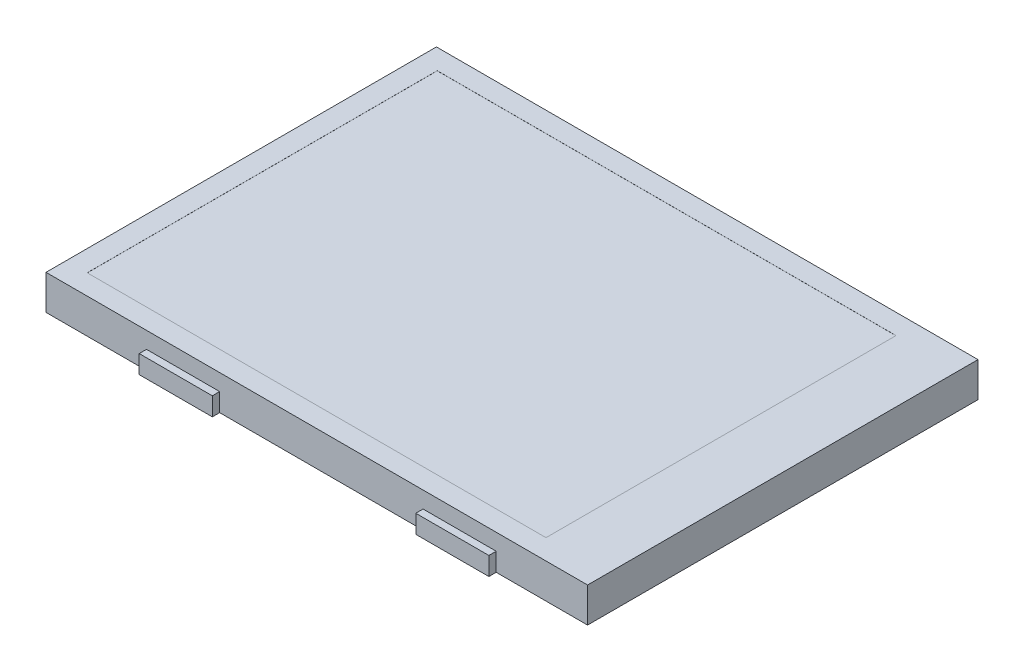
ISO-10303-21;
HEADER;
FILE_DESCRIPTION(('STEP AP214'),'2;1');
FILE_NAME('part.step','',(''),(''),'','','');
FILE_SCHEMA(('AUTOMOTIVE_DESIGN { 1 0 10303 214 1 1 1 1 }'));
ENDSEC;
DATA;
#1=APPLICATION_CONTEXT('core data for automotive mechanical design processes');
#2=APPLICATION_PROTOCOL_DEFINITION('international standard','automotive_design',2000,#1);
#3=PRODUCT_CONTEXT('',#1,'mechanical');
#4=PRODUCT('Part','Part','',(#3));
#5=PRODUCT_RELATED_PRODUCT_CATEGORY('part','',(#4));
#6=PRODUCT_DEFINITION_FORMATION('','',#4);
#7=PRODUCT_DEFINITION_CONTEXT('part definition',#1,'design');
#8=PRODUCT_DEFINITION('design','',#6,#7);
#9=PRODUCT_DEFINITION_SHAPE('','',#8);
#10=(LENGTH_UNIT() NAMED_UNIT(*) SI_UNIT(.MILLI.,.METRE.));
#11=(NAMED_UNIT(*) PLANE_ANGLE_UNIT() SI_UNIT($,.RADIAN.));
#12=(NAMED_UNIT(*) SI_UNIT($,.STERADIAN.) SOLID_ANGLE_UNIT());
#13=UNCERTAINTY_MEASURE_WITH_UNIT(LENGTH_MEASURE(1.E-05),#10,'distance_accuracy_value','');
#14=(GEOMETRIC_REPRESENTATION_CONTEXT(3) GLOBAL_UNCERTAINTY_ASSIGNED_CONTEXT((#13)) GLOBAL_UNIT_ASSIGNED_CONTEXT((#10,
#11,#12)) REPRESENTATION_CONTEXT('',''));
#15=CARTESIAN_POINT('',(0.,0.,0.));
#16=DIRECTION('',(0.,0.,1.));
#17=DIRECTION('',(1.,0.,0.));
#18=AXIS2_PLACEMENT_3D('',#15,#16,#17);
#19=CARTESIAN_POINT('',(-29.63,3.8,-21.36));
#20=DIRECTION('',(0.,0.,1.));
#21=DIRECTION('',(1.,0.,0.));
#22=AXIS2_PLACEMENT_3D('',#19,#20,#21);
#23=PLANE('',#22);
#24=DIRECTION('',(0.,-1.,0.));
#25=VECTOR('',#24,1.);
#26=CARTESIAN_POINT('',(19.63,0.,-21.36));
#27=LINE('',#26,#25);
#28=CARTESIAN_POINT('',(19.63,2.,-21.36));
#29=VERTEX_POINT('',#28);
#30=CARTESIAN_POINT('',(19.63,0.,-21.36));
#31=VERTEX_POINT('',#30);
#32=EDGE_CURVE('E67',#29,#31,#27,.T.);
#33=ORIENTED_EDGE('',*,*,#32,.F.);
#34=DIRECTION('',(1.,0.,0.));
#35=VECTOR('',#34,1.);
#36=CARTESIAN_POINT('',(19.63,2.,-21.36));
#37=LINE('',#36,#35);
#38=CARTESIAN_POINT('',(11.63,2.,-21.36));
#39=VERTEX_POINT('',#38);
#40=EDGE_CURVE('E251',#39,#29,#37,.T.);
#41=ORIENTED_EDGE('',*,*,#40,.F.);
#42=DIRECTION('',(0.,1.,0.));
#43=VECTOR('',#42,1.);
#44=CARTESIAN_POINT('',(11.63,2.,-21.36));
#45=LINE('',#44,#43);
#46=CARTESIAN_POINT('',(11.63,0.,-21.36));
#47=VERTEX_POINT('',#46);
#48=EDGE_CURVE('E262',#47,#39,#45,.T.);
#49=ORIENTED_EDGE('',*,*,#48,.F.);
#50=DIRECTION('',(-1.,0.,0.));
#51=VECTOR('',#50,1.);
#52=CARTESIAN_POINT('',(-29.63,0.,-21.36));
#53=LINE('',#52,#51);
#54=CARTESIAN_POINT('',(-10.63,0.,-21.36));
#55=VERTEX_POINT('',#54);
#56=EDGE_CURVE('E441',#47,#55,#53,.T.);
#57=ORIENTED_EDGE('',*,*,#56,.T.);
#58=DIRECTION('',(0.,-1.,0.));
#59=VECTOR('',#58,1.);
#60=CARTESIAN_POINT('',(-10.63,0.,-21.36));
#61=LINE('',#60,#59);
#62=CARTESIAN_POINT('',(-10.63,2.,-21.36));
#63=VERTEX_POINT('',#62);
#64=EDGE_CURVE('E313',#63,#55,#61,.T.);
#65=ORIENTED_EDGE('',*,*,#64,.F.);
#66=DIRECTION('',(1.,0.,0.));
#67=VECTOR('',#66,1.);
#68=CARTESIAN_POINT('',(-10.63,2.,-21.36));
#69=LINE('',#68,#67);
#70=CARTESIAN_POINT('',(-18.63,2.,-21.36));
#71=VERTEX_POINT('',#70);
#72=EDGE_CURVE('E294',#71,#63,#69,.T.);
#73=ORIENTED_EDGE('',*,*,#72,.F.);
#74=DIRECTION('',(0.,1.,0.));
#75=VECTOR('',#74,1.);
#76=CARTESIAN_POINT('',(-18.63,2.,-21.36));
#77=LINE('',#76,#75);
#78=CARTESIAN_POINT('',(-18.63,0.,-21.36));
#79=VERTEX_POINT('',#78);
#80=EDGE_CURVE('E300',#79,#71,#77,.T.);
#81=ORIENTED_EDGE('',*,*,#80,.F.);
#82=CARTESIAN_POINT('',(-29.63,0.,-21.36));
#83=VERTEX_POINT('',#82);
#84=EDGE_CURVE('E436',#79,#83,#53,.T.);
#85=ORIENTED_EDGE('',*,*,#84,.T.);
#86=DIRECTION('',(0.,-1.,0.));
#87=VECTOR('',#86,1.);
#88=CARTESIAN_POINT('',(-29.63,3.8,-21.36));
#89=LINE('',#88,#87);
#90=CARTESIAN_POINT('',(-29.63,3.8,-21.36));
#91=VERTEX_POINT('',#90);
#92=EDGE_CURVE('E52',#91,#83,#89,.T.);
#93=ORIENTED_EDGE('',*,*,#92,.F.);
#94=DIRECTION('',(-1.,0.,0.));
#95=VECTOR('',#94,1.);
#96=CARTESIAN_POINT('',(-29.63,3.8,-21.36));
#97=LINE('',#96,#95);
#98=CARTESIAN_POINT('',(29.63,3.8,-21.36));
#99=VERTEX_POINT('',#98);
#100=EDGE_CURVE('E422',#99,#91,#97,.T.);
#101=ORIENTED_EDGE('',*,*,#100,.F.);
#102=DIRECTION('',(0.,-1.,0.));
#103=VECTOR('',#102,1.);
#104=CARTESIAN_POINT('',(29.63,3.8,-21.36));
#105=LINE('',#104,#103);
#106=CARTESIAN_POINT('',(29.63,0.,-21.36));
#107=VERTEX_POINT('',#106);
#108=EDGE_CURVE('E11',#99,#107,#105,.T.);
#109=ORIENTED_EDGE('',*,*,#108,.T.);
#110=EDGE_CURVE('E437',#107,#31,#53,.T.);
#111=ORIENTED_EDGE('',*,*,#110,.T.);
#112=EDGE_LOOP('',(#33,#41,#49,#57,#65,#73,#81,#85,#93,#101,#109,#111));
#113=FACE_BOUND('',#112,.T.);
#114=ADVANCED_FACE('F43',(#113),#23,.F.);
#115=CARTESIAN_POINT('',(-29.63,3.8,21.36));
#116=DIRECTION('',(0.,0.,-1.));
#117=DIRECTION('',(-1.,0.,0.));
#118=AXIS2_PLACEMENT_3D('',#115,#116,#117);
#119=PLANE('',#118);
#120=DIRECTION('',(0.,-1.,0.));
#121=VECTOR('',#120,1.);
#122=CARTESIAN_POINT('',(11.63,2.,21.36));
#123=LINE('',#122,#121);
#124=CARTESIAN_POINT('',(11.63,2.,21.36));
#125=VERTEX_POINT('',#124);
#126=CARTESIAN_POINT('',(11.63,0.,21.36));
#127=VERTEX_POINT('',#126);
#128=EDGE_CURVE('E335',#125,#127,#123,.T.);
#129=ORIENTED_EDGE('',*,*,#128,.F.);
#130=DIRECTION('',(-1.,0.,0.));
#131=VECTOR('',#130,1.);
#132=CARTESIAN_POINT('',(11.63,2.,21.36));
#133=LINE('',#132,#131);
#134=CARTESIAN_POINT('',(19.63,2.,21.36));
#135=VERTEX_POINT('',#134);
#136=EDGE_CURVE('E341',#135,#125,#133,.T.);
#137=ORIENTED_EDGE('',*,*,#136,.F.);
#138=DIRECTION('',(0.,1.,0.));
#139=VECTOR('',#138,1.);
#140=CARTESIAN_POINT('',(19.63,2.,21.36));
#141=LINE('',#140,#139);
#142=CARTESIAN_POINT('',(19.63,0.,21.36));
#143=VERTEX_POINT('',#142);
#144=EDGE_CURVE('E354',#143,#135,#141,.T.);
#145=ORIENTED_EDGE('',*,*,#144,.F.);
#146=DIRECTION('',(1.,0.,0.));
#147=VECTOR('',#146,1.);
#148=CARTESIAN_POINT('',(-29.63,0.,21.36));
#149=LINE('',#148,#147);
#150=CARTESIAN_POINT('',(29.63,0.,21.36));
#151=VERTEX_POINT('',#150);
#152=EDGE_CURVE('E444',#143,#151,#149,.T.);
#153=ORIENTED_EDGE('',*,*,#152,.T.);
#154=DIRECTION('',(0.,-1.,0.));
#155=VECTOR('',#154,1.);
#156=CARTESIAN_POINT('',(29.63,3.8,21.36));
#157=LINE('',#156,#155);
#158=CARTESIAN_POINT('',(29.63,3.8,21.36));
#159=VERTEX_POINT('',#158);
#160=EDGE_CURVE('E432',#159,#151,#157,.T.);
#161=ORIENTED_EDGE('',*,*,#160,.F.);
#162=DIRECTION('',(1.,0.,0.));
#163=VECTOR('',#162,1.);
#164=CARTESIAN_POINT('',(-29.63,3.8,21.36));
#165=LINE('',#164,#163);
#166=CARTESIAN_POINT('',(-29.63,3.8,21.36));
#167=VERTEX_POINT('',#166);
#168=EDGE_CURVE('E429',#167,#159,#165,.T.);
#169=ORIENTED_EDGE('',*,*,#168,.F.);
#170=DIRECTION('',(0.,-1.,0.));
#171=VECTOR('',#170,1.);
#172=CARTESIAN_POINT('',(-29.63,3.8,21.36));
#173=LINE('',#172,#171);
#174=CARTESIAN_POINT('',(-29.63,0.,21.36));
#175=VERTEX_POINT('',#174);
#176=EDGE_CURVE('E451',#167,#175,#173,.T.);
#177=ORIENTED_EDGE('',*,*,#176,.T.);
#178=CARTESIAN_POINT('',(-18.63,0.,21.36));
#179=VERTEX_POINT('',#178);
#180=EDGE_CURVE('E423',#175,#179,#149,.T.);
#181=ORIENTED_EDGE('',*,*,#180,.T.);
#182=DIRECTION('',(0.,-1.,0.));
#183=VECTOR('',#182,1.);
#184=CARTESIAN_POINT('',(-18.63,2.,21.36));
#185=LINE('',#184,#183);
#186=CARTESIAN_POINT('',(-18.63,2.,21.36));
#187=VERTEX_POINT('',#186);
#188=EDGE_CURVE('E376',#187,#179,#185,.T.);
#189=ORIENTED_EDGE('',*,*,#188,.F.);
#190=DIRECTION('',(-1.,0.,0.));
#191=VECTOR('',#190,1.);
#192=CARTESIAN_POINT('',(-18.63,2.,21.36));
#193=LINE('',#192,#191);
#194=CARTESIAN_POINT('',(-10.63,2.,21.36));
#195=VERTEX_POINT('',#194);
#196=EDGE_CURVE('E382',#195,#187,#193,.T.);
#197=ORIENTED_EDGE('',*,*,#196,.F.);
#198=DIRECTION('',(0.,1.,0.));
#199=VECTOR('',#198,1.);
#200=CARTESIAN_POINT('',(-10.63,2.,21.36));
#201=LINE('',#200,#199);
#202=CARTESIAN_POINT('',(-10.63,0.,21.36));
#203=VERTEX_POINT('',#202);
#204=EDGE_CURVE('E395',#203,#195,#201,.T.);
#205=ORIENTED_EDGE('',*,*,#204,.F.);
#206=EDGE_CURVE('E447',#203,#127,#149,.T.);
#207=ORIENTED_EDGE('',*,*,#206,.T.);
#208=EDGE_LOOP('',(#129,#137,#145,#153,#161,#169,#177,#181,#189,#197,#205,#207));
#209=FACE_BOUND('',#208,.T.);
#210=ADVANCED_FACE('F470',(#209),#119,.F.);
#211=CARTESIAN_POINT('',(29.63,3.8,21.36));
#212=DIRECTION('',(-1.,0.,0.));
#213=DIRECTION('',(0.,0.,1.));
#214=AXIS2_PLACEMENT_3D('',#211,#212,#213);
#215=PLANE('',#214);
#216=DIRECTION('',(0.,0.,-1.));
#217=VECTOR('',#216,1.);
#218=CARTESIAN_POINT('',(29.63,0.,21.36));
#219=LINE('',#218,#217);
#220=EDGE_CURVE('E417',#151,#107,#219,.T.);
#221=ORIENTED_EDGE('',*,*,#220,.T.);
#222=ORIENTED_EDGE('',*,*,#108,.F.);
#223=DIRECTION('',(0.,0.,-1.));
#224=VECTOR('',#223,1.);
#225=CARTESIAN_POINT('',(29.63,3.8,21.36));
#226=LINE('',#225,#224);
#227=EDGE_CURVE('E418',#159,#99,#226,.T.);
#228=ORIENTED_EDGE('',*,*,#227,.F.);
#229=ORIENTED_EDGE('',*,*,#160,.T.);
#230=EDGE_LOOP('',(#221,#222,#228,#229));
#231=FACE_BOUND('',#230,.T.);
#232=ADVANCED_FACE('F45',(#231),#215,.F.);
#233=CARTESIAN_POINT('',(-29.63,3.8,21.36));
#234=DIRECTION('',(1.,0.,0.));
#235=DIRECTION('',(0.,0.,-1.));
#236=AXIS2_PLACEMENT_3D('',#233,#234,#235);
#237=PLANE('',#236);
#238=DIRECTION('',(0.,0.,1.));
#239=VECTOR('',#238,1.);
#240=CARTESIAN_POINT('',(-29.63,0.,21.36));
#241=LINE('',#240,#239);
#242=EDGE_CURVE('E440',#83,#175,#241,.T.);
#243=ORIENTED_EDGE('',*,*,#242,.T.);
#244=ORIENTED_EDGE('',*,*,#176,.F.);
#245=DIRECTION('',(0.,0.,1.));
#246=VECTOR('',#245,1.);
#247=CARTESIAN_POINT('',(-29.63,3.8,21.36));
#248=LINE('',#247,#246);
#249=EDGE_CURVE('E426',#91,#167,#248,.T.);
#250=ORIENTED_EDGE('',*,*,#249,.F.);
#251=ORIENTED_EDGE('',*,*,#92,.T.);
#252=EDGE_LOOP('',(#243,#244,#250,#251));
#253=FACE_BOUND('',#252,.T.);
#254=ADVANCED_FACE('F460',(#253),#237,.F.);
#255=CARTESIAN_POINT('',(0.,3.8,0.));
#256=DIRECTION('',(0.,-1.,0.));
#257=DIRECTION('',(0.,0.,-1.));
#258=AXIS2_PLACEMENT_3D('',#255,#256,#257);
#259=PLANE('',#258);
#260=DIRECTION('',(1.,0.,0.));
#261=VECTOR('',#260,1.);
#262=CARTESIAN_POINT('',(-27.33,3.8,19.15));
#263=LINE('',#262,#261);
#264=CARTESIAN_POINT('',(-27.33,3.8,19.15));
#265=VERTEX_POINT('',#264);
#266=CARTESIAN_POINT('',(22.87,3.8,19.15));
#267=VERTEX_POINT('',#266);
#268=EDGE_CURVE('E243',#265,#267,#263,.T.);
#269=ORIENTED_EDGE('',*,*,#268,.F.);
#270=DIRECTION('',(0.,0.,1.));
#271=VECTOR('',#270,1.);
#272=CARTESIAN_POINT('',(-27.33,3.8,-19.15));
#273=LINE('',#272,#271);
#274=CARTESIAN_POINT('',(-27.33,3.8,-19.15));
#275=VERTEX_POINT('',#274);
#276=EDGE_CURVE('E59',#275,#265,#273,.T.);
#277=ORIENTED_EDGE('',*,*,#276,.F.);
#278=DIRECTION('',(-1.,0.,0.));
#279=VECTOR('',#278,1.);
#280=CARTESIAN_POINT('',(-27.33,3.8,-19.15));
#281=LINE('',#280,#279);
#282=CARTESIAN_POINT('',(22.87,3.8,-19.15));
#283=VERTEX_POINT('',#282);
#284=EDGE_CURVE('E228',#283,#275,#281,.T.);
#285=ORIENTED_EDGE('',*,*,#284,.F.);
#286=DIRECTION('',(0.,0.,-1.));
#287=VECTOR('',#286,1.);
#288=CARTESIAN_POINT('',(22.87,3.8,-19.15));
#289=LINE('',#288,#287);
#290=EDGE_CURVE('E234',#267,#283,#289,.T.);
#291=ORIENTED_EDGE('',*,*,#290,.F.);
#292=EDGE_LOOP('',(#269,#277,#285,#291));
#293=FACE_BOUND('',#292,.T.);
#294=ORIENTED_EDGE('',*,*,#227,.T.);
#295=ORIENTED_EDGE('',*,*,#100,.T.);
#296=ORIENTED_EDGE('',*,*,#249,.T.);
#297=ORIENTED_EDGE('',*,*,#168,.T.);
#298=EDGE_LOOP('',(#294,#295,#296,#297));
#299=FACE_BOUND('',#298,.T.);
#300=ADVANCED_FACE('F475',(#293,#299),#259,.F.);
#301=CARTESIAN_POINT('',(0.,0.,0.));
#302=DIRECTION('',(0.,-1.,0.));
#303=DIRECTION('',(0.,0.,-1.));
#304=AXIS2_PLACEMENT_3D('',#301,#302,#303);
#305=PLANE('',#304);
#306=ORIENTED_EDGE('',*,*,#220,.F.);
#307=ORIENTED_EDGE('',*,*,#152,.F.);
#308=DIRECTION('',(0.,0.,-1.));
#309=VECTOR('',#308,1.);
#310=CARTESIAN_POINT('',(19.63,0.,22.16));
#311=LINE('',#310,#309);
#312=CARTESIAN_POINT('',(19.63,0.,22.16));
#313=VERTEX_POINT('',#312);
#314=EDGE_CURVE('E368',#313,#143,#311,.T.);
#315=ORIENTED_EDGE('',*,*,#314,.F.);
#316=DIRECTION('',(1.,0.,0.));
#317=VECTOR('',#316,1.);
#318=CARTESIAN_POINT('',(11.63,0.,22.16));
#319=LINE('',#318,#317);
#320=CARTESIAN_POINT('',(11.63,0.,22.16));
#321=VERTEX_POINT('',#320);
#322=EDGE_CURVE('E340',#321,#313,#319,.T.);
#323=ORIENTED_EDGE('',*,*,#322,.F.);
#324=DIRECTION('',(0.,0.,-1.));
#325=VECTOR('',#324,1.);
#326=CARTESIAN_POINT('',(11.63,0.,22.16));
#327=LINE('',#326,#325);
#328=EDGE_CURVE('E372',#321,#127,#327,.T.);
#329=ORIENTED_EDGE('',*,*,#328,.T.);
#330=ORIENTED_EDGE('',*,*,#206,.F.);
#331=DIRECTION('',(0.,0.,-1.));
#332=VECTOR('',#331,1.);
#333=CARTESIAN_POINT('',(-10.63,0.,22.16));
#334=LINE('',#333,#332);
#335=CARTESIAN_POINT('',(-10.63,0.,22.16));
#336=VERTEX_POINT('',#335);
#337=EDGE_CURVE('E409',#336,#203,#334,.T.);
#338=ORIENTED_EDGE('',*,*,#337,.F.);
#339=DIRECTION('',(1.,0.,0.));
#340=VECTOR('',#339,1.);
#341=CARTESIAN_POINT('',(-18.63,0.,22.16));
#342=LINE('',#341,#340);
#343=CARTESIAN_POINT('',(-18.63,0.,22.16));
#344=VERTEX_POINT('',#343);
#345=EDGE_CURVE('E381',#344,#336,#342,.T.);
#346=ORIENTED_EDGE('',*,*,#345,.F.);
#347=DIRECTION('',(0.,0.,-1.));
#348=VECTOR('',#347,1.);
#349=CARTESIAN_POINT('',(-18.63,0.,22.16));
#350=LINE('',#349,#348);
#351=EDGE_CURVE('E413',#344,#179,#350,.T.);
#352=ORIENTED_EDGE('',*,*,#351,.T.);
#353=ORIENTED_EDGE('',*,*,#180,.F.);
#354=ORIENTED_EDGE('',*,*,#242,.F.);
#355=ORIENTED_EDGE('',*,*,#84,.F.);
#356=DIRECTION('',(0.,0.,1.));
#357=VECTOR('',#356,1.);
#358=CARTESIAN_POINT('',(-18.63,0.,-22.16));
#359=LINE('',#358,#357);
#360=CARTESIAN_POINT('',(-18.63,0.,-22.16));
#361=VERTEX_POINT('',#360);
#362=EDGE_CURVE('E323',#361,#79,#359,.T.);
#363=ORIENTED_EDGE('',*,*,#362,.F.);
#364=DIRECTION('',(-1.,0.,0.));
#365=VECTOR('',#364,1.);
#366=CARTESIAN_POINT('',(-18.63,0.,-22.16));
#367=LINE('',#366,#365);
#368=CARTESIAN_POINT('',(-10.63,0.,-22.16));
#369=VERTEX_POINT('',#368);
#370=EDGE_CURVE('E303',#369,#361,#367,.T.);
#371=ORIENTED_EDGE('',*,*,#370,.F.);
#372=DIRECTION('',(0.,0.,1.));
#373=VECTOR('',#372,1.);
#374=CARTESIAN_POINT('',(-10.63,0.,-22.16));
#375=LINE('',#374,#373);
#376=EDGE_CURVE('E327',#369,#55,#375,.T.);
#377=ORIENTED_EDGE('',*,*,#376,.T.);
#378=ORIENTED_EDGE('',*,*,#56,.F.);
#379=DIRECTION('',(0.,0.,1.));
#380=VECTOR('',#379,1.);
#381=CARTESIAN_POINT('',(11.63,0.,-22.16));
#382=LINE('',#381,#380);
#383=CARTESIAN_POINT('',(11.63,0.,-22.16));
#384=VERTEX_POINT('',#383);
#385=EDGE_CURVE('E283',#384,#47,#382,.T.);
#386=ORIENTED_EDGE('',*,*,#385,.F.);
#387=DIRECTION('',(-1.,0.,0.));
#388=VECTOR('',#387,1.);
#389=CARTESIAN_POINT('',(11.63,0.,-22.16));
#390=LINE('',#389,#388);
#391=CARTESIAN_POINT('',(19.63,0.,-22.16));
#392=VERTEX_POINT('',#391);
#393=EDGE_CURVE('E265',#392,#384,#390,.T.);
#394=ORIENTED_EDGE('',*,*,#393,.F.);
#395=DIRECTION('',(0.,0.,1.));
#396=VECTOR('',#395,1.);
#397=CARTESIAN_POINT('',(19.63,0.,-22.16));
#398=LINE('',#397,#396);
#399=EDGE_CURVE('E287',#392,#31,#398,.T.);
#400=ORIENTED_EDGE('',*,*,#399,.T.);
#401=ORIENTED_EDGE('',*,*,#110,.F.);
#402=EDGE_LOOP('',(#306,#307,#315,#323,#329,#330,#338,#346,#352,#353,#354,#355,#363,#371,#377,
#378,#386,#394,#400,#401));
#403=FACE_BOUND('',#402,.T.);
#404=ADVANCED_FACE('F466',(#403),#305,.T.);
#405=CARTESIAN_POINT('',(-18.63,2.,22.16));
#406=DIRECTION('',(1.,0.,0.));
#407=DIRECTION('',(0.,0.,-1.));
#408=AXIS2_PLACEMENT_3D('',#405,#406,#407);
#409=PLANE('',#408);
#410=ORIENTED_EDGE('',*,*,#188,.T.);
#411=ORIENTED_EDGE('',*,*,#351,.F.);
#412=DIRECTION('',(0.,-1.,0.));
#413=VECTOR('',#412,1.);
#414=CARTESIAN_POINT('',(-18.63,2.,22.16));
#415=LINE('',#414,#413);
#416=CARTESIAN_POINT('',(-18.63,2.,22.16));
#417=VERTEX_POINT('',#416);
#418=EDGE_CURVE('E377',#417,#344,#415,.T.);
#419=ORIENTED_EDGE('',*,*,#418,.F.);
#420=DIRECTION('',(0.,0.,-1.));
#421=VECTOR('',#420,1.);
#422=CARTESIAN_POINT('',(-18.63,2.,22.16));
#423=LINE('',#422,#421);
#424=EDGE_CURVE('E391',#417,#187,#423,.T.);
#425=ORIENTED_EDGE('',*,*,#424,.T.);
#426=EDGE_LOOP('',(#410,#411,#419,#425));
#427=FACE_BOUND('',#426,.T.);
#428=ADVANCED_FACE('F529',(#427),#409,.F.);
#429=CARTESIAN_POINT('',(-10.63,2.,22.16));
#430=DIRECTION('',(-1.,0.,0.));
#431=DIRECTION('',(0.,0.,1.));
#432=AXIS2_PLACEMENT_3D('',#429,#430,#431);
#433=PLANE('',#432);
#434=ORIENTED_EDGE('',*,*,#204,.T.);
#435=DIRECTION('',(0.,0.,-1.));
#436=VECTOR('',#435,1.);
#437=CARTESIAN_POINT('',(-10.63,2.,22.16));
#438=LINE('',#437,#436);
#439=CARTESIAN_POINT('',(-10.63,2.,22.16));
#440=VERTEX_POINT('',#439);
#441=EDGE_CURVE('E405',#440,#195,#438,.T.);
#442=ORIENTED_EDGE('',*,*,#441,.F.);
#443=DIRECTION('',(0.,1.,0.));
#444=VECTOR('',#443,1.);
#445=CARTESIAN_POINT('',(-10.63,2.,22.16));
#446=LINE('',#445,#444);
#447=EDGE_CURVE('E385',#336,#440,#446,.T.);
#448=ORIENTED_EDGE('',*,*,#447,.F.);
#449=ORIENTED_EDGE('',*,*,#337,.T.);
#450=EDGE_LOOP('',(#434,#442,#448,#449));
#451=FACE_BOUND('',#450,.T.);
#452=ADVANCED_FACE('F535',(#451),#433,.F.);
#453=CARTESIAN_POINT('',(-18.63,2.,22.16));
#454=DIRECTION('',(0.,-1.,0.));
#455=DIRECTION('',(0.,0.,-1.));
#456=AXIS2_PLACEMENT_3D('',#453,#454,#455);
#457=PLANE('',#456);
#458=ORIENTED_EDGE('',*,*,#196,.T.);
#459=ORIENTED_EDGE('',*,*,#424,.F.);
#460=DIRECTION('',(-1.,0.,0.));
#461=VECTOR('',#460,1.);
#462=CARTESIAN_POINT('',(-18.63,2.,22.16));
#463=LINE('',#462,#461);
#464=EDGE_CURVE('E388',#440,#417,#463,.T.);
#465=ORIENTED_EDGE('',*,*,#464,.F.);
#466=ORIENTED_EDGE('',*,*,#441,.T.);
#467=EDGE_LOOP('',(#458,#459,#465,#466));
#468=FACE_BOUND('',#467,.T.);
#469=ADVANCED_FACE('F539',(#468),#457,.F.);
#470=CARTESIAN_POINT('',(0.,0.,22.16));
#471=DIRECTION('',(0.,0.,1.));
#472=DIRECTION('',(1.,0.,0.));
#473=AXIS2_PLACEMENT_3D('',#470,#471,#472);
#474=PLANE('',#473);
#475=ORIENTED_EDGE('',*,*,#418,.T.);
#476=ORIENTED_EDGE('',*,*,#345,.T.);
#477=ORIENTED_EDGE('',*,*,#447,.T.);
#478=ORIENTED_EDGE('',*,*,#464,.T.);
#479=EDGE_LOOP('',(#475,#476,#477,#478));
#480=FACE_BOUND('',#479,.T.);
#481=ADVANCED_FACE('F543',(#480),#474,.T.);
#482=CARTESIAN_POINT('',(11.63,2.,22.16));
#483=DIRECTION('',(1.,0.,0.));
#484=DIRECTION('',(0.,0.,-1.));
#485=AXIS2_PLACEMENT_3D('',#482,#483,#484);
#486=PLANE('',#485);
#487=ORIENTED_EDGE('',*,*,#128,.T.);
#488=ORIENTED_EDGE('',*,*,#328,.F.);
#489=DIRECTION('',(0.,-1.,0.));
#490=VECTOR('',#489,1.);
#491=CARTESIAN_POINT('',(11.63,2.,22.16));
#492=LINE('',#491,#490);
#493=CARTESIAN_POINT('',(11.63,2.,22.16));
#494=VERTEX_POINT('',#493);
#495=EDGE_CURVE('E336',#494,#321,#492,.T.);
#496=ORIENTED_EDGE('',*,*,#495,.F.);
#497=DIRECTION('',(0.,0.,-1.));
#498=VECTOR('',#497,1.);
#499=CARTESIAN_POINT('',(11.63,2.,22.16));
#500=LINE('',#499,#498);
#501=EDGE_CURVE('E350',#494,#125,#500,.T.);
#502=ORIENTED_EDGE('',*,*,#501,.T.);
#503=EDGE_LOOP('',(#487,#488,#496,#502));
#504=FACE_BOUND('',#503,.T.);
#505=ADVANCED_FACE('F547',(#504),#486,.F.);
#506=CARTESIAN_POINT('',(19.63,2.,22.16));
#507=DIRECTION('',(-1.,0.,0.));
#508=DIRECTION('',(0.,0.,1.));
#509=AXIS2_PLACEMENT_3D('',#506,#507,#508);
#510=PLANE('',#509);
#511=ORIENTED_EDGE('',*,*,#144,.T.);
#512=DIRECTION('',(0.,0.,-1.));
#513=VECTOR('',#512,1.);
#514=CARTESIAN_POINT('',(19.63,2.,22.16));
#515=LINE('',#514,#513);
#516=CARTESIAN_POINT('',(19.63,2.,22.16));
#517=VERTEX_POINT('',#516);
#518=EDGE_CURVE('E364',#517,#135,#515,.T.);
#519=ORIENTED_EDGE('',*,*,#518,.F.);
#520=DIRECTION('',(0.,1.,0.));
#521=VECTOR('',#520,1.);
#522=CARTESIAN_POINT('',(19.63,2.,22.16));
#523=LINE('',#522,#521);
#524=EDGE_CURVE('E344',#313,#517,#523,.T.);
#525=ORIENTED_EDGE('',*,*,#524,.F.);
#526=ORIENTED_EDGE('',*,*,#314,.T.);
#527=EDGE_LOOP('',(#511,#519,#525,#526));
#528=FACE_BOUND('',#527,.T.);
#529=ADVANCED_FACE('F551',(#528),#510,.F.);
#530=CARTESIAN_POINT('',(11.63,2.,22.16));
#531=DIRECTION('',(0.,-1.,0.));
#532=DIRECTION('',(0.,0.,-1.));
#533=AXIS2_PLACEMENT_3D('',#530,#531,#532);
#534=PLANE('',#533);
#535=ORIENTED_EDGE('',*,*,#136,.T.);
#536=ORIENTED_EDGE('',*,*,#501,.F.);
#537=DIRECTION('',(-1.,0.,0.));
#538=VECTOR('',#537,1.);
#539=CARTESIAN_POINT('',(11.63,2.,22.16));
#540=LINE('',#539,#538);
#541=EDGE_CURVE('E347',#517,#494,#540,.T.);
#542=ORIENTED_EDGE('',*,*,#541,.F.);
#543=ORIENTED_EDGE('',*,*,#518,.T.);
#544=EDGE_LOOP('',(#535,#536,#542,#543));
#545=FACE_BOUND('',#544,.T.);
#546=ADVANCED_FACE('F555',(#545),#534,.F.);
#547=CARTESIAN_POINT('',(0.,0.,22.16));
#548=DIRECTION('',(0.,0.,1.));
#549=DIRECTION('',(1.,0.,0.));
#550=AXIS2_PLACEMENT_3D('',#547,#548,#549);
#551=PLANE('',#550);
#552=ORIENTED_EDGE('',*,*,#495,.T.);
#553=ORIENTED_EDGE('',*,*,#322,.T.);
#554=ORIENTED_EDGE('',*,*,#524,.T.);
#555=ORIENTED_EDGE('',*,*,#541,.T.);
#556=EDGE_LOOP('',(#552,#553,#554,#555));
#557=FACE_BOUND('',#556,.T.);
#558=ADVANCED_FACE('F517',(#557),#551,.T.);
#559=CARTESIAN_POINT('',(-10.63,2.,-22.16));
#560=DIRECTION('',(0.,-1.,0.));
#561=DIRECTION('',(0.,0.,-1.));
#562=AXIS2_PLACEMENT_3D('',#559,#560,#561);
#563=PLANE('',#562);
#564=ORIENTED_EDGE('',*,*,#72,.T.);
#565=DIRECTION('',(0.,0.,1.));
#566=VECTOR('',#565,1.);
#567=CARTESIAN_POINT('',(-10.63,2.,-22.16));
#568=LINE('',#567,#566);
#569=CARTESIAN_POINT('',(-10.63,2.,-22.16));
#570=VERTEX_POINT('',#569);
#571=EDGE_CURVE('E331',#570,#63,#568,.T.);
#572=ORIENTED_EDGE('',*,*,#571,.F.);
#573=DIRECTION('',(1.,0.,0.));
#574=VECTOR('',#573,1.);
#575=CARTESIAN_POINT('',(-10.63,2.,-22.16));
#576=LINE('',#575,#574);
#577=CARTESIAN_POINT('',(-18.63,2.,-22.16));
#578=VERTEX_POINT('',#577);
#579=EDGE_CURVE('E295',#578,#570,#576,.T.);
#580=ORIENTED_EDGE('',*,*,#579,.F.);
#581=DIRECTION('',(0.,0.,1.));
#582=VECTOR('',#581,1.);
#583=CARTESIAN_POINT('',(-18.63,2.,-22.16));
#584=LINE('',#583,#582);
#585=EDGE_CURVE('E309',#578,#71,#584,.T.);
#586=ORIENTED_EDGE('',*,*,#585,.T.);
#587=EDGE_LOOP('',(#564,#572,#580,#586));
#588=FACE_BOUND('',#587,.T.);
#589=ADVANCED_FACE('F504',(#588),#563,.F.);
#590=CARTESIAN_POINT('',(-10.63,0.,-22.16));
#591=DIRECTION('',(-1.,0.,0.));
#592=DIRECTION('',(0.,0.,1.));
#593=AXIS2_PLACEMENT_3D('',#590,#591,#592);
#594=PLANE('',#593);
#595=ORIENTED_EDGE('',*,*,#64,.T.);
#596=ORIENTED_EDGE('',*,*,#376,.F.);
#597=DIRECTION('',(0.,-1.,0.));
#598=VECTOR('',#597,1.);
#599=CARTESIAN_POINT('',(-10.63,0.,-22.16));
#600=LINE('',#599,#598);
#601=EDGE_CURVE('E299',#570,#369,#600,.T.);
#602=ORIENTED_EDGE('',*,*,#601,.F.);
#603=ORIENTED_EDGE('',*,*,#571,.T.);
#604=EDGE_LOOP('',(#595,#596,#602,#603));
#605=FACE_BOUND('',#604,.T.);
#606=ADVANCED_FACE('F509',(#605),#594,.F.);
#607=CARTESIAN_POINT('',(-18.63,2.,-22.16));
#608=DIRECTION('',(1.,0.,0.));
#609=DIRECTION('',(0.,0.,-1.));
#610=AXIS2_PLACEMENT_3D('',#607,#608,#609);
#611=PLANE('',#610);
#612=ORIENTED_EDGE('',*,*,#80,.T.);
#613=ORIENTED_EDGE('',*,*,#585,.F.);
#614=DIRECTION('',(0.,1.,0.));
#615=VECTOR('',#614,1.);
#616=CARTESIAN_POINT('',(-18.63,2.,-22.16));
#617=LINE('',#616,#615);
#618=EDGE_CURVE('E306',#361,#578,#617,.T.);
#619=ORIENTED_EDGE('',*,*,#618,.F.);
#620=ORIENTED_EDGE('',*,*,#362,.T.);
#621=EDGE_LOOP('',(#612,#613,#619,#620));
#622=FACE_BOUND('',#621,.T.);
#623=ADVANCED_FACE('F500',(#622),#611,.F.);
#624=CARTESIAN_POINT('',(0.,0.,-22.16));
#625=DIRECTION('',(0.,0.,1.));
#626=DIRECTION('',(1.,0.,0.));
#627=AXIS2_PLACEMENT_3D('',#624,#625,#626);
#628=PLANE('',#627);
#629=ORIENTED_EDGE('',*,*,#579,.T.);
#630=ORIENTED_EDGE('',*,*,#601,.T.);
#631=ORIENTED_EDGE('',*,*,#370,.T.);
#632=ORIENTED_EDGE('',*,*,#618,.T.);
#633=EDGE_LOOP('',(#629,#630,#631,#632));
#634=FACE_BOUND('',#633,.T.);
#635=ADVANCED_FACE('F507',(#634),#628,.F.);
#636=CARTESIAN_POINT('',(19.63,2.,-22.16));
#637=DIRECTION('',(0.,-1.,0.));
#638=DIRECTION('',(0.,0.,-1.));
#639=AXIS2_PLACEMENT_3D('',#636,#637,#638);
#640=PLANE('',#639);
#641=ORIENTED_EDGE('',*,*,#40,.T.);
#642=DIRECTION('',(0.,0.,1.));
#643=VECTOR('',#642,1.);
#644=CARTESIAN_POINT('',(19.63,2.,-22.16));
#645=LINE('',#644,#643);
#646=CARTESIAN_POINT('',(19.63,2.,-22.16));
#647=VERTEX_POINT('',#646);
#648=EDGE_CURVE('E291',#647,#29,#645,.T.);
#649=ORIENTED_EDGE('',*,*,#648,.F.);
#650=DIRECTION('',(1.,0.,0.));
#651=VECTOR('',#650,1.);
#652=CARTESIAN_POINT('',(19.63,2.,-22.16));
#653=LINE('',#652,#651);
#654=CARTESIAN_POINT('',(11.63,2.,-22.16));
#655=VERTEX_POINT('',#654);
#656=EDGE_CURVE('E257',#655,#647,#653,.T.);
#657=ORIENTED_EDGE('',*,*,#656,.F.);
#658=DIRECTION('',(0.,0.,1.));
#659=VECTOR('',#658,1.);
#660=CARTESIAN_POINT('',(11.63,2.,-22.16));
#661=LINE('',#660,#659);
#662=EDGE_CURVE('E271',#655,#39,#661,.T.);
#663=ORIENTED_EDGE('',*,*,#662,.T.);
#664=EDGE_LOOP('',(#641,#649,#657,#663));
#665=FACE_BOUND('',#664,.T.);
#666=ADVANCED_FACE('F488',(#665),#640,.F.);
#667=CARTESIAN_POINT('',(19.63,0.,-22.16));
#668=DIRECTION('',(-1.,0.,0.));
#669=DIRECTION('',(0.,0.,1.));
#670=AXIS2_PLACEMENT_3D('',#667,#668,#669);
#671=PLANE('',#670);
#672=ORIENTED_EDGE('',*,*,#32,.T.);
#673=ORIENTED_EDGE('',*,*,#399,.F.);
#674=DIRECTION('',(0.,-1.,0.));
#675=VECTOR('',#674,1.);
#676=CARTESIAN_POINT('',(19.63,0.,-22.16));
#677=LINE('',#676,#675);
#678=EDGE_CURVE('E261',#647,#392,#677,.T.);
#679=ORIENTED_EDGE('',*,*,#678,.F.);
#680=ORIENTED_EDGE('',*,*,#648,.T.);
#681=EDGE_LOOP('',(#672,#673,#679,#680));
#682=FACE_BOUND('',#681,.T.);
#683=ADVANCED_FACE('F484',(#682),#671,.F.);
#684=CARTESIAN_POINT('',(11.63,2.,-22.16));
#685=DIRECTION('',(1.,0.,0.));
#686=DIRECTION('',(0.,0.,-1.));
#687=AXIS2_PLACEMENT_3D('',#684,#685,#686);
#688=PLANE('',#687);
#689=ORIENTED_EDGE('',*,*,#48,.T.);
#690=ORIENTED_EDGE('',*,*,#662,.F.);
#691=DIRECTION('',(0.,1.,0.));
#692=VECTOR('',#691,1.);
#693=CARTESIAN_POINT('',(11.63,2.,-22.16));
#694=LINE('',#693,#692);
#695=EDGE_CURVE('E268',#384,#655,#694,.T.);
#696=ORIENTED_EDGE('',*,*,#695,.F.);
#697=ORIENTED_EDGE('',*,*,#385,.T.);
#698=EDGE_LOOP('',(#689,#690,#696,#697));
#699=FACE_BOUND('',#698,.T.);
#700=ADVANCED_FACE('F492',(#699),#688,.F.);
#701=CARTESIAN_POINT('',(0.,0.,-22.16));
#702=DIRECTION('',(0.,0.,1.));
#703=DIRECTION('',(1.,0.,0.));
#704=AXIS2_PLACEMENT_3D('',#701,#702,#703);
#705=PLANE('',#704);
#706=ORIENTED_EDGE('',*,*,#656,.T.);
#707=ORIENTED_EDGE('',*,*,#678,.T.);
#708=ORIENTED_EDGE('',*,*,#393,.T.);
#709=ORIENTED_EDGE('',*,*,#695,.T.);
#710=EDGE_LOOP('',(#706,#707,#708,#709));
#711=FACE_BOUND('',#710,.T.);
#712=ADVANCED_FACE('F622',(#711),#705,.F.);
#713=CARTESIAN_POINT('',(-27.33,3.79,-19.15));
#714=DIRECTION('',(-1.,0.,0.));
#715=DIRECTION('',(0.,0.,1.));
#716=AXIS2_PLACEMENT_3D('',#713,#714,#715);
#717=PLANE('',#716);
#718=ORIENTED_EDGE('',*,*,#276,.T.);
#719=DIRECTION('',(0.,1.,0.));
#720=VECTOR('',#719,1.);
#721=CARTESIAN_POINT('',(-27.33,3.79,19.15));
#722=LINE('',#721,#720);
#723=CARTESIAN_POINT('',(-27.33,3.79,19.15));
#724=VERTEX_POINT('',#723);
#725=EDGE_CURVE('E203',#724,#265,#722,.T.);
#726=ORIENTED_EDGE('',*,*,#725,.F.);
#727=DIRECTION('',(0.,0.,1.));
#728=VECTOR('',#727,1.);
#729=CARTESIAN_POINT('',(-27.33,3.79,-19.15));
#730=LINE('',#729,#728);
#731=CARTESIAN_POINT('',(-27.33,3.79,-19.15));
#732=VERTEX_POINT('',#731);
#733=EDGE_CURVE('E207',#732,#724,#730,.T.);
#734=ORIENTED_EDGE('',*,*,#733,.F.);
#735=DIRECTION('',(0.,1.,0.));
#736=VECTOR('',#735,1.);
#737=CARTESIAN_POINT('',(-27.33,3.79,-19.15));
#738=LINE('',#737,#736);
#739=EDGE_CURVE('E248',#732,#275,#738,.T.);
#740=ORIENTED_EDGE('',*,*,#739,.T.);
#741=EDGE_LOOP('',(#718,#726,#734,#740));
#742=FACE_BOUND('',#741,.T.);
#743=ADVANCED_FACE('F205',(#742),#717,.F.);
#744=CARTESIAN_POINT('',(-27.33,3.79,-19.15));
#745=DIRECTION('',(0.,0.,-1.));
#746=DIRECTION('',(-1.,0.,0.));
#747=AXIS2_PLACEMENT_3D('',#744,#745,#746);
#748=PLANE('',#747);
#749=ORIENTED_EDGE('',*,*,#284,.T.);
#750=ORIENTED_EDGE('',*,*,#739,.F.);
#751=DIRECTION('',(-1.,0.,0.));
#752=VECTOR('',#751,1.);
#753=CARTESIAN_POINT('',(-27.33,3.79,-19.15));
#754=LINE('',#753,#752);
#755=CARTESIAN_POINT('',(22.87,3.79,-19.15));
#756=VERTEX_POINT('',#755);
#757=EDGE_CURVE('E214',#756,#732,#754,.T.);
#758=ORIENTED_EDGE('',*,*,#757,.F.);
#759=DIRECTION('',(0.,1.,0.));
#760=VECTOR('',#759,1.);
#761=CARTESIAN_POINT('',(22.87,3.79,-19.15));
#762=LINE('',#761,#760);
#763=EDGE_CURVE('E252',#756,#283,#762,.T.);
#764=ORIENTED_EDGE('',*,*,#763,.T.);
#765=EDGE_LOOP('',(#749,#750,#758,#764));
#766=FACE_BOUND('',#765,.T.);
#767=ADVANCED_FACE('F637',(#766),#748,.F.);
#768=CARTESIAN_POINT('',(22.87,3.79,-19.15));
#769=DIRECTION('',(1.,0.,0.));
#770=DIRECTION('',(0.,0.,-1.));
#771=AXIS2_PLACEMENT_3D('',#768,#769,#770);
#772=PLANE('',#771);
#773=ORIENTED_EDGE('',*,*,#290,.T.);
#774=ORIENTED_EDGE('',*,*,#763,.F.);
#775=DIRECTION('',(0.,0.,-1.));
#776=VECTOR('',#775,1.);
#777=CARTESIAN_POINT('',(22.87,3.79,-19.15));
#778=LINE('',#777,#776);
#779=CARTESIAN_POINT('',(22.87,3.79,19.15));
#780=VERTEX_POINT('',#779);
#781=EDGE_CURVE('E223',#780,#756,#778,.T.);
#782=ORIENTED_EDGE('',*,*,#781,.F.);
#783=DIRECTION('',(0.,1.,0.));
#784=VECTOR('',#783,1.);
#785=CARTESIAN_POINT('',(22.87,3.79,19.15));
#786=LINE('',#785,#784);
#787=EDGE_CURVE('E213',#780,#267,#786,.T.);
#788=ORIENTED_EDGE('',*,*,#787,.T.);
#789=EDGE_LOOP('',(#773,#774,#782,#788));
#790=FACE_BOUND('',#789,.T.);
#791=ADVANCED_FACE('F646',(#790),#772,.F.);
#792=CARTESIAN_POINT('',(-27.33,3.79,19.15));
#793=DIRECTION('',(0.,0.,1.));
#794=DIRECTION('',(1.,0.,0.));
#795=AXIS2_PLACEMENT_3D('',#792,#793,#794);
#796=PLANE('',#795);
#797=ORIENTED_EDGE('',*,*,#268,.T.);
#798=ORIENTED_EDGE('',*,*,#787,.F.);
#799=DIRECTION('',(1.,0.,0.));
#800=VECTOR('',#799,1.);
#801=CARTESIAN_POINT('',(-27.33,3.79,19.15));
#802=LINE('',#801,#800);
#803=EDGE_CURVE('E217',#724,#780,#802,.T.);
#804=ORIENTED_EDGE('',*,*,#803,.F.);
#805=ORIENTED_EDGE('',*,*,#725,.T.);
#806=EDGE_LOOP('',(#797,#798,#804,#805));
#807=FACE_BOUND('',#806,.T.);
#808=ADVANCED_FACE('F218',(#807),#796,.F.);
#809=CARTESIAN_POINT('',(0.,3.79,0.));
#810=DIRECTION('',(0.,1.,0.));
#811=DIRECTION('',(0.,0.,1.));
#812=AXIS2_PLACEMENT_3D('',#809,#810,#811);
#813=PLANE('',#812);
#814=ORIENTED_EDGE('',*,*,#733,.T.);
#815=ORIENTED_EDGE('',*,*,#803,.T.);
#816=ORIENTED_EDGE('',*,*,#781,.T.);
#817=ORIENTED_EDGE('',*,*,#757,.T.);
#818=EDGE_LOOP('',(#814,#815,#816,#817));
#819=FACE_BOUND('',#818,.T.);
#820=ADVANCED_FACE('F225',(#819),#813,.T.);
#821=CLOSED_SHELL('',(#114,#210,#232,#254,#300,#404,#428,#452,#469,#481,#505,#529,#546,#558,
#589,#606,#623,#635,#666,#683,#700,#712,#743,#767,#791,#808,#820));
#822=MANIFOLD_SOLID_BREP('B2',#821);
#823=ADVANCED_BREP_SHAPE_REPRESENTATION('',(#18,#822),#14);
#824=SHAPE_DEFINITION_REPRESENTATION(#9,#823);
ENDSEC;
END-ISO-10303-21;
